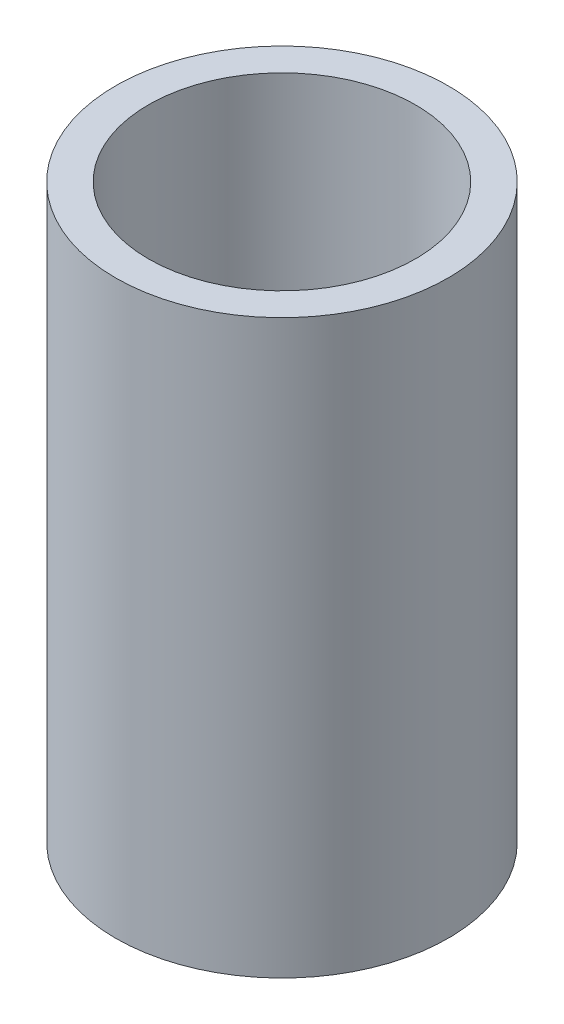
ISO-10303-21;
HEADER;
FILE_DESCRIPTION(('STEP AP214'),'2;1');
FILE_NAME('part.step','',(''),(''),'','','');
FILE_SCHEMA(('AUTOMOTIVE_DESIGN { 1 0 10303 214 1 1 1 1 }'));
ENDSEC;
DATA;
#1=APPLICATION_CONTEXT('core data for automotive mechanical design processes');
#2=APPLICATION_PROTOCOL_DEFINITION('international standard','automotive_design',2000,#1);
#3=PRODUCT_CONTEXT('',#1,'mechanical');
#4=PRODUCT('Part','Part','',(#3));
#5=PRODUCT_RELATED_PRODUCT_CATEGORY('part','',(#4));
#6=PRODUCT_DEFINITION_FORMATION('','',#4);
#7=PRODUCT_DEFINITION_CONTEXT('part definition',#1,'design');
#8=PRODUCT_DEFINITION('design','',#6,#7);
#9=PRODUCT_DEFINITION_SHAPE('','',#8);
#10=(LENGTH_UNIT() NAMED_UNIT(*) SI_UNIT(.MILLI.,.METRE.));
#11=(NAMED_UNIT(*) PLANE_ANGLE_UNIT() SI_UNIT($,.RADIAN.));
#12=(NAMED_UNIT(*) SI_UNIT($,.STERADIAN.) SOLID_ANGLE_UNIT());
#13=UNCERTAINTY_MEASURE_WITH_UNIT(LENGTH_MEASURE(1.E-05),#10,'distance_accuracy_value','');
#14=(GEOMETRIC_REPRESENTATION_CONTEXT(3) GLOBAL_UNCERTAINTY_ASSIGNED_CONTEXT((#13)) GLOBAL_UNIT_ASSIGNED_CONTEXT((#10,
#11,#12)) REPRESENTATION_CONTEXT('',''));
#15=CARTESIAN_POINT('',(0.,0.,0.));
#16=DIRECTION('',(0.,0.,1.));
#17=DIRECTION('',(1.,0.,0.));
#18=AXIS2_PLACEMENT_3D('',#15,#16,#17);
#19=CARTESIAN_POINT('',(0.,27.5,0.));
#20=DIRECTION('',(0.,1.,0.));
#21=DIRECTION('',(0.,0.,1.));
#22=AXIS2_PLACEMENT_3D('',#19,#20,#21);
#23=PLANE('',#22);
#24=CARTESIAN_POINT('',(0.,27.5,0.));
#25=DIRECTION('',(0.,1.,0.));
#26=DIRECTION('',(0.,0.,1.));
#27=AXIS2_PLACEMENT_3D('',#24,#25,#26);
#28=CIRCLE('',#27,16.);
#29=CARTESIAN_POINT('',(0.,27.5,16.));
#30=VERTEX_POINT('',#29);
#31=EDGE_CURVE('E10',#30,#30,#28,.T.);
#32=ORIENTED_EDGE('',*,*,#31,.T.);
#33=EDGE_LOOP('',(#32));
#34=FACE_BOUND('',#33,.T.);
#35=CARTESIAN_POINT('',(0.,27.5,0.));
#36=DIRECTION('',(0.,1.,0.));
#37=DIRECTION('',(0.,0.,1.));
#38=AXIS2_PLACEMENT_3D('',#35,#36,#37);
#39=CIRCLE('',#38,12.8397);
#40=CARTESIAN_POINT('',(0.,27.5,12.8397));
#41=VERTEX_POINT('',#40);
#42=EDGE_CURVE('E50',#41,#41,#39,.T.);
#43=ORIENTED_EDGE('',*,*,#42,.F.);
#44=EDGE_LOOP('',(#43));
#45=FACE_BOUND('',#44,.T.);
#46=ADVANCED_FACE('F37',(#34,#45),#23,.T.);
#47=CARTESIAN_POINT('',(0.,-27.5,0.));
#48=DIRECTION('',(0.,1.,0.));
#49=DIRECTION('',(0.,0.,1.));
#50=AXIS2_PLACEMENT_3D('',#47,#48,#49);
#51=PLANE('',#50);
#52=CARTESIAN_POINT('',(0.,-27.5,0.));
#53=DIRECTION('',(0.,1.,0.));
#54=DIRECTION('',(0.,0.,1.));
#55=AXIS2_PLACEMENT_3D('',#52,#53,#54);
#56=CIRCLE('',#55,16.);
#57=CARTESIAN_POINT('',(0.,-27.5,16.));
#58=VERTEX_POINT('',#57);
#59=EDGE_CURVE('E41',#58,#58,#56,.T.);
#60=ORIENTED_EDGE('',*,*,#59,.F.);
#61=EDGE_LOOP('',(#60));
#62=FACE_BOUND('',#61,.T.);
#63=CARTESIAN_POINT('',(0.,-27.5,0.));
#64=DIRECTION('',(0.,1.,0.));
#65=DIRECTION('',(0.,0.,1.));
#66=AXIS2_PLACEMENT_3D('',#63,#64,#65);
#67=CIRCLE('',#66,12.8397);
#68=CARTESIAN_POINT('',(0.,-27.5,12.8397));
#69=VERTEX_POINT('',#68);
#70=EDGE_CURVE('E52',#69,#69,#67,.T.);
#71=ORIENTED_EDGE('',*,*,#70,.T.);
#72=EDGE_LOOP('',(#71));
#73=FACE_BOUND('',#72,.T.);
#74=ADVANCED_FACE('F86',(#62,#73),#51,.F.);
#75=CARTESIAN_POINT('',(0.,27.5,0.));
#76=DIRECTION('',(0.,-1.,0.));
#77=DIRECTION('',(0.,0.,-1.));
#78=AXIS2_PLACEMENT_3D('',#75,#76,#77);
#79=CYLINDRICAL_SURFACE('',#78,16.);
#80=CARTESIAN_POINT('',(2.,0.,-15.8745078663875));
#81=CARTESIAN_POINT('',(1.99999524386716,-0.111869027033463,-15.8745094733706));
#82=CARTESIAN_POINT('',(1.99058231921703,-0.223807971923852,-15.8757031609516));
#83=CARTESIAN_POINT('',(1.95318113097707,-0.444570580323687,-15.8803471278398));
#84=CARTESIAN_POINT('',(1.92517345687304,-0.553390864397634,-15.8837997651437));
#85=CARTESIAN_POINT('',(1.85142135426077,-0.764687905692824,-15.8925645902034));
#86=CARTESIAN_POINT('',(1.80568896383859,-0.867168913694928,-15.8978755156292));
#87=CARTESIAN_POINT('',(1.69781135874362,-1.06298276145846,-15.9097569881593));
#88=CARTESIAN_POINT('',(1.63566894989983,-1.15631716139444,-15.9163273198743));
#89=CARTESIAN_POINT('',(1.49636276021153,-1.3317297976977,-15.9300284739512));
#90=CARTESIAN_POINT('',(1.41912545201944,-1.41374944185511,-15.9371619336163));
#91=CARTESIAN_POINT('',(1.25198020853698,-1.56369821515126,-15.9511618630067));
#92=CARTESIAN_POINT('',(1.16207164324643,-1.63162664327575,-15.9580283194351));
#93=CARTESIAN_POINT('',(0.971767864540777,-1.75167486360509,-15.9707475569026));
#94=CARTESIAN_POINT('',(0.871338956448891,-1.80374163607973,-15.9765969107744));
#95=CARTESIAN_POINT('',(0.663077374444734,-1.89024895995277,-15.9865938956362));
#96=CARTESIAN_POINT('',(0.555244975488724,-1.92469016554121,-15.9907415897837));
#97=CARTESIAN_POINT('',(0.33583655020089,-1.97479365466754,-15.9968493496498));
#98=CARTESIAN_POINT('',(0.224283087730703,-1.99055334281911,-15.9988207586875));
#99=CARTESIAN_POINT('',(9.85605492377487E-05,-2.00314830802923,-16.0003925578337));
#100=CARTESIAN_POINT('',(-0.112532461595816,-1.99998432956203,-15.9999930412166));
#101=CARTESIAN_POINT('',(-0.335012215179638,-1.97489983779406,-15.9968771821601));
#102=CARTESIAN_POINT('',(-0.444872964611562,-1.9530840812149,-15.9941737796458));
#103=CARTESIAN_POINT('',(-0.6593617311243,-1.89147905869605,-15.9867684475387));
#104=CARTESIAN_POINT('',(-0.763989648684964,-1.85168945106654,-15.9820664799524));
#105=CARTESIAN_POINT('',(-0.965367052350911,-1.75515480577297,-15.9711700624633));
#106=CARTESIAN_POINT('',(-1.06209458227242,-1.69836443381586,-15.9649716307459));
#107=CARTESIAN_POINT('',(-1.24468596184518,-1.56947331022718,-15.9517757525223));
#108=CARTESIAN_POINT('',(-1.33054931297389,-1.49737185642514,-15.9447782693781));
#109=CARTESIAN_POINT('',(-1.48959042461836,-1.3393185451213,-15.9307109401881));
#110=CARTESIAN_POINT('',(-1.5626774719968,-1.25327539236267,-15.9236409264378));
#111=CARTESIAN_POINT('',(-1.69338628050008,-1.07009475457404,-15.9102725755246));
#112=CARTESIAN_POINT('',(-1.75100799314808,-0.972957234769554,-15.9039742407806));
#113=CARTESIAN_POINT('',(-1.84915565886619,-0.770264403550139,-15.8928624209017));
#114=CARTESIAN_POINT('',(-1.88967434388986,-0.664705536037441,-15.888049567265));
#115=CARTESIAN_POINT('',(-1.95238532357447,-0.448208437178536,-15.8804659399676));
#116=CARTESIAN_POINT('',(-1.9745785014397,-0.337270465353024,-15.8776950678936));
#117=CARTESIAN_POINT('',(-1.99988834552689,-0.113965454400189,-15.8745271102724));
#118=CARTESIAN_POINT('',(-2.00313267359863,-0.00161310152896618,-15.874114139539));
#119=CARTESIAN_POINT('',(-1.99078956258445,0.22203354373233,-15.8756667289572));
#120=CARTESIAN_POINT('',(-1.97520252488785,0.333327858623452,-15.8776322384116));
#121=CARTESIAN_POINT('',(-1.92574662863818,0.55131661086229,-15.8837058278719));
#122=CARTESIAN_POINT('',(-1.89193958699685,0.658025292152324,-15.8878066615573));
#123=CARTESIAN_POINT('',(-1.8070669752929,0.864259323882524,-15.8976829597665));
#124=CARTESIAN_POINT('',(-1.75600079886498,0.963784421792695,-15.9034584831261));
#125=CARTESIAN_POINT('',(-1.63774561772394,1.15340371505039,-15.9160714508259));
#126=CARTESIAN_POINT('',(-1.57047289566169,1.24344533225154,-15.9229143418967));
#127=CARTESIAN_POINT('',(-1.42183259389516,1.41100524314803,-15.9368739164082));
#128=CARTESIAN_POINT('',(-1.34046446594039,1.48852304949439,-15.9439906104903));
#129=CARTESIAN_POINT('',(-1.16538542044682,1.62928334986752,-15.9577447094957));
#130=CARTESIAN_POINT('',(-1.07160679369363,1.69244195743599,-15.9643791513002));
#131=CARTESIAN_POINT('',(-0.874698065345432,1.80211057410704,-15.9763769042529));
#132=CARTESIAN_POINT('',(-0.771568152294659,1.84862091878478,-15.9817402410217));
#133=CARTESIAN_POINT('',(-0.559163087311564,1.92353422952643,-15.9905783252255));
#134=CARTESIAN_POINT('',(-0.449905253209423,1.95198567682529,-15.9940581255016));
#135=CARTESIAN_POINT('',(-0.228116845822369,1.99013127138141,-15.9987580374205));
#136=CARTESIAN_POINT('',(-0.115586420350486,1.99982626447939,-15.9999782509614));
#137=CARTESIAN_POINT('',(0.108733746675027,2.00016793783372,-16.0000210241093));
#138=CARTESIAN_POINT('',(0.220523310171787,1.99094396845438,-15.9988598653427));
#139=CARTESIAN_POINT('',(0.44095019316209,1.95398350925533,-15.9943027292635));
#140=CARTESIAN_POINT('',(0.549587514847879,1.92624703231059,-15.9909067535052));
#141=CARTESIAN_POINT('',(0.760609154389852,1.85308950852024,-15.9822598816963));
#142=CARTESIAN_POINT('',(0.862995648127657,1.80767465650142,-15.9770096354758));
#143=CARTESIAN_POINT('',(1.05871466971522,1.70046294831396,-15.9652355808503));
#144=CARTESIAN_POINT('',(1.15204708991042,1.63866589739065,-15.958711757305));
#145=CARTESIAN_POINT('',(1.32766941437005,1.4999654277309,-15.9450655514046));
#146=CARTESIAN_POINT('',(1.40988303026744,1.42296576518108,-15.9379395302314));
#147=CARTESIAN_POINT('',(1.56027289505548,1.25624564477691,-15.9239212721083));
#148=CARTESIAN_POINT('',(1.62844581423479,1.16652217800728,-15.917029090936));
#149=CARTESIAN_POINT('',(1.74904419401283,0.97650406184211,-15.9042304911575));
#150=CARTESIAN_POINT('',(1.80140782653339,0.876169928051929,-15.8983279820183));
#151=CARTESIAN_POINT('',(1.88846823067468,0.668114607524193,-15.888222864957));
#152=CARTESIAN_POINT('',(1.92318421698265,0.560401600557285,-15.884018409231));
#153=CARTESIAN_POINT('',(1.96565271699038,0.376776010365174,-15.8788062945587));
#154=CARTESIAN_POINT('',(1.97851442480846,0.302021638769942,-15.8772024121753));
#155=CARTESIAN_POINT('',(1.99568964472441,0.151522200026459,-15.8750526578393));
#156=CARTESIAN_POINT('',(2.00000322167946,0.075777140399238,-15.8745067778594));
#157=CARTESIAN_POINT('',(2.,0.,-15.8745078663875));
#158=B_SPLINE_CURVE_WITH_KNOTS('',3,(#80,#81,#82,#83,#84,#85,#86,#87,#88,#89,#90,#91,#92,#93,
#94,#95,#96,#97,#98,#99,#100,#101,#102,#103,#104,#105,#106,#107,#108,#109,#110,#111,#112,#113,
#114,#115,#116,#117,#118,#119,#120,#121,#122,#123,#124,#125,#126,#127,#128,#129,#130,#131,#132,
#133,#134,#135,#136,#137,#138,#139,#140,#141,#142,#143,#144,#145,#146,#147,#148,#149,#150,#151,
#152,#153,#154,#155,#156,#157),.UNSPECIFIED.,.T.,.F.,(4,2,2,2,2,2,2,2,2,2,2,2,2,2,2,2,2,2,2,2,2,
2,2,2,2,2,2,2,2,2,2,2,2,2,2,2,2,2,4),(0.,0.335330253983391,0.671011100921905,1.00646436206496,
1.3418603036049,1.67893262039253,2.01602170194063,2.35422548916593,2.69241672271864,
3.02883677553166,3.36524359336087,3.69977331946431,4.03430940537431,4.36974563530243,
4.70519725175284,5.04294157902216,5.3806869649554,5.71857573391207,6.05644821724951,
6.39204174244706,6.72762811461692,7.06208301034186,7.39654965769482,7.73278255635289,
8.06902853595849,8.40719108713874,8.74534682167103,9.08259085427953,9.4198196781825,
9.75475053030604,10.0896811494943,10.4244945083527,10.759311847714,11.0963210311267,
11.4334100435186,11.7718007816387,12.1098222878561,12.3369679170636,12.5641118228438),.UNSPECIFIED.);
#159=CARTESIAN_POINT('',(2.,0.,-15.8745078663875));
#160=VERTEX_POINT('',#159);
#161=EDGE_CURVE('E56',#160,#160,#158,.T.);
#162=ORIENTED_EDGE('',*,*,#161,.F.);
#163=EDGE_LOOP('',(#162));
#164=FACE_BOUND('',#163,.T.);
#165=ORIENTED_EDGE('',*,*,#31,.F.);
#166=EDGE_LOOP('',(#165));
#167=FACE_BOUND('',#166,.T.);
#168=ORIENTED_EDGE('',*,*,#59,.T.);
#169=EDGE_LOOP('',(#168));
#170=FACE_BOUND('',#169,.T.);
#171=ADVANCED_FACE('F39',(#164,#167,#170),#79,.T.);
#172=CARTESIAN_POINT('',(0.,27.5,0.));
#173=DIRECTION('',(0.,-1.,0.));
#174=DIRECTION('',(0.,0.,-1.));
#175=AXIS2_PLACEMENT_3D('',#172,#173,#174);
#176=CYLINDRICAL_SURFACE('',#175,12.8397);
#177=CARTESIAN_POINT('',(2.,0.,-12.6829766257768));
#178=CARTESIAN_POINT('',(1.99999542977878,-0.111607276056529,-12.6829785457113));
#179=CARTESIAN_POINT('',(1.9906262550867,-0.223278057069677,-12.6844657521694));
#180=CARTESIAN_POINT('',(1.95340916992859,-0.443493718604813,-12.6902493969685));
#181=CARTESIAN_POINT('',(1.92554356429497,-0.552035501820932,-12.6945485253615));
#182=CARTESIAN_POINT('',(1.85219070531248,-0.762773914635226,-12.7054575408193));
#183=CARTESIAN_POINT('',(1.8067173774827,-0.864975484629886,-12.7120656014036));
#184=CARTESIAN_POINT('',(1.69947334207441,-1.06028466337821,-12.7268457550844));
#185=CARTESIAN_POINT('',(1.6377047406341,-1.15339344523092,-12.7350176460208));
#186=CARTESIAN_POINT('',(1.49905486623623,-1.32869033521887,-12.7520834759852));
#187=CARTESIAN_POINT('',(1.42206067640262,-1.41078864914235,-12.7609824991777));
#188=CARTESIAN_POINT('',(1.2553891117973,-1.5609553895935,-12.7784545932513));
#189=CARTESIAN_POINT('',(1.16571102229922,-1.62902302497351,-12.7870276457297));
#190=CARTESIAN_POINT('',(0.97563976613991,-1.74952949425379,-12.8029352549501));
#191=CARTESIAN_POINT('',(0.875193376616871,-1.80188533580186,-12.8102631492856));
#192=CARTESIAN_POINT('',(0.666799091609416,-1.88894915359878,-12.8227983844469));
#193=CARTESIAN_POINT('',(0.55885162333829,-1.92365813396469,-12.8280058459232));
#194=CARTESIAN_POINT('',(0.339445239072281,-1.97416992566217,-12.8356775995631));
#195=CARTESIAN_POINT('',(0.228021758164113,-1.99012328547367,-12.8381637241908));
#196=CARTESIAN_POINT('',(0.00405357392589063,-2.00313866942103,-12.8401875741457));
#197=CARTESIAN_POINT('',(-0.10849106202608,-2.00020182204504,-12.8397254755978));
#198=CARTESIAN_POINT('',(-0.330478957235813,-1.97563849650837,-12.8359223352649));
#199=CARTESIAN_POINT('',(-0.439940628625049,-1.95417400238219,-12.8326062461628));
#200=CARTESIAN_POINT('',(-0.653689310900628,-1.89341921356911,-12.8234955215894));
#201=CARTESIAN_POINT('',(-0.757976180140698,-1.85412843123383,-12.8177008183144));
#202=CARTESIAN_POINT('',(-0.95890235867002,-1.75867218476378,-12.8042411982205));
#203=CARTESIAN_POINT('',(-1.05550897996187,-1.7024390132491,-12.7965688010508));
#204=CARTESIAN_POINT('',(-1.23797598004017,-1.57474373089401,-12.7802079916615));
#205=CARTESIAN_POINT('',(-1.32383559627582,-1.50328054038296,-12.7715195074303));
#206=CARTESIAN_POINT('',(-1.48332694066247,-1.34625273070919,-12.7539858519419));
#207=CARTESIAN_POINT('',(-1.55681936912239,-1.26054663295548,-12.7451399961125));
#208=CARTESIAN_POINT('',(-1.68840108800969,-1.07794522818329,-12.728378185602));
#209=CARTESIAN_POINT('',(-1.74649026892984,-0.981049841623157,-12.720462237532));
#210=CARTESIAN_POINT('',(-1.84563822593332,-0.77866970537138,-12.7064565152555));
#211=CARTESIAN_POINT('',(-1.88668186456936,-0.673177420137374,-12.7003683655653));
#212=CARTESIAN_POINT('',(-1.95042917272159,-0.456680485902559,-12.6907356527962));
#213=CARTESIAN_POINT('',(-1.97313424162605,-0.345676258195963,-12.687190895637));
#214=CARTESIAN_POINT('',(-1.99936714704614,-0.122548148921297,-12.6830833843374));
#215=CARTESIAN_POINT('',(-2.00309281981069,-0.0104480737915694,-12.682489868792));
#216=CARTESIAN_POINT('',(-1.99178687903282,0.212775016673244,-12.6842702826835));
#217=CARTESIAN_POINT('',(-1.9767558948551,0.323898064665708,-12.6866441125535));
#218=CARTESIAN_POINT('',(-1.92853140531546,0.54139463469342,-12.6940634341268));
#219=CARTESIAN_POINT('',(-1.89543717724934,0.647790711097513,-12.6990943175652));
#220=CARTESIAN_POINT('',(-1.81212917783692,0.853525951972127,-12.7112487753018));
#221=CARTESIAN_POINT('',(-1.76191450051324,0.952864742650028,-12.7183724603437));
#222=CARTESIAN_POINT('',(-1.64531850401305,1.14255026661764,-12.7339820010502));
#223=CARTESIAN_POINT('',(-1.57880954956105,1.23281766039176,-12.7424784212926));
#224=CARTESIAN_POINT('',(-1.43168962123954,1.40098087837006,-12.7598445926537));
#225=CARTESIAN_POINT('',(-1.35107778529713,1.47887594573003,-12.7687143665693));
#226=CARTESIAN_POINT('',(-1.17716734120527,1.62079783873587,-12.7859243764992));
#227=CARTESIAN_POINT('',(-1.08376088735345,1.68469327656428,-12.7942591162978));
#228=CARTESIAN_POINT('',(-0.887425051562714,1.79588512282439,-12.8093736407735));
#229=CARTESIAN_POINT('',(-0.784495946636571,1.84318201391408,-12.8161534706628));
#230=CARTESIAN_POINT('',(-0.572440123105982,1.91962607404538,-12.8273702558943));
#231=CARTESIAN_POINT('',(-0.463339431648914,1.94884404596164,-12.8318163404163));
#232=CARTESIAN_POINT('',(-0.241705527864347,1.98852964793012,-12.8379030964421));
#233=CARTESIAN_POINT('',(-0.12917256139234,1.99899861778925,-12.8395439684064));
#234=CARTESIAN_POINT('',(0.0948592684789221,2.00085437846246,-12.8398331331113));
#235=CARTESIAN_POINT('',(0.206356480772478,1.99244182218366,-12.8385128935217));
#236=CARTESIAN_POINT('',(0.426329938814471,1.95720473092383,-12.8330918918235));
#237=CARTESIAN_POINT('',(0.534806196516737,1.93038026880893,-12.8289911407188));
#238=CARTESIAN_POINT('',(0.745596163367876,1.85915397745186,-12.8184678786045));
#239=CARTESIAN_POINT('',(0.847915032597578,1.81476710920334,-12.812047344166));
#240=CARTESIAN_POINT('',(1.04368427827067,1.70969767956155,-12.7975882723877));
#241=CARTESIAN_POINT('',(1.13713432160449,1.64901450641313,-12.7895496743094));
#242=CARTESIAN_POINT('',(1.31352868347907,1.51235419810328,-12.7726457758987));
#243=CARTESIAN_POINT('',(1.39635781662491,1.43622930122635,-12.7637729703121));
#244=CARTESIAN_POINT('',(1.54813840323443,1.27115726359509,-12.7462549869285));
#245=CARTESIAN_POINT('',(1.61708659873067,1.18220712104061,-12.737609862983));
#246=CARTESIAN_POINT('',(1.73952868899153,0.993369657310034,-12.7214694302167));
#247=CARTESIAN_POINT('',(1.79292582572072,0.893418976800107,-12.713981450886));
#248=CARTESIAN_POINT('',(1.88209325894994,0.685895674524483,-12.7010892562388));
#249=CARTESIAN_POINT('',(1.91788162046716,0.578330994211954,-12.6956829066015));
#250=CARTESIAN_POINT('',(1.96280986898783,0.391920080612976,-12.6887985026181));
#251=CARTESIAN_POINT('',(1.9767344864936,0.314217938406258,-12.6866270609447));
#252=CARTESIAN_POINT('',(1.99533109913859,0.157687754972058,-12.6837154546665));
#253=CARTESIAN_POINT('',(2.0000032292376,0.0788597301839604,-12.6829752691849));
#254=CARTESIAN_POINT('',(2.,0.,-12.6829766257768));
#255=B_SPLINE_CURVE_WITH_KNOTS('',3,(#177,#178,#179,#180,#181,#182,#183,#184,#185,#186,#187,
#188,#189,#190,#191,#192,#193,#194,#195,#196,#197,#198,#199,#200,#201,#202,#203,#204,#205,#206,
#207,#208,#209,#210,#211,#212,#213,#214,#215,#216,#217,#218,#219,#220,#221,#222,#223,#224,#225,
#226,#227,#228,#229,#230,#231,#232,#233,#234,#235,#236,#237,#238,#239,#240,#241,#242,#243,#244,
#245,#246,#247,#248,#249,#250,#251,#252,#253,#254),.UNSPECIFIED.,.T.,.F.,(4,2,2,2,2,2,2,2,2,2,2,
2,2,2,2,2,2,2,2,2,2,2,2,2,2,2,2,2,2,2,2,2,2,2,2,2,2,2,4),(0.,0.334533542957228,
0.669387589659937,1.00397734758014,1.33852388147499,1.67565142198752,2.01279796690811,
2.35169523931521,2.69057322610413,3.02671210603486,3.36283090544359,3.69604050187787,
4.02925921400191,4.36382765080858,4.69841981338619,5.03655953152533,5.37470165355713,
5.71314342691742,6.05155937186193,6.38644043316251,6.72131025809763,7.05435787297391,
7.38742311475016,7.72318575244836,8.05896892162995,8.39777994708913,8.73658111967359,
9.07404689748069,9.4114885589631,9.74536124502395,10.0792326097727,10.4128201677403,
10.7464202501692,11.0833774354427,11.4204136153061,11.7595040868262,12.0982459529255,
12.3346248941633,12.5710003874755),.UNSPECIFIED.);
#256=CARTESIAN_POINT('',(2.,0.,-12.6829766257768));
#257=VERTEX_POINT('',#256);
#258=EDGE_CURVE('E68',#257,#257,#255,.T.);
#259=ORIENTED_EDGE('',*,*,#258,.T.);
#260=EDGE_LOOP('',(#259));
#261=FACE_BOUND('',#260,.T.);
#262=ORIENTED_EDGE('',*,*,#42,.T.);
#263=EDGE_LOOP('',(#262));
#264=FACE_BOUND('',#263,.T.);
#265=ORIENTED_EDGE('',*,*,#70,.F.);
#266=EDGE_LOOP('',(#265));
#267=FACE_BOUND('',#266,.T.);
#268=ADVANCED_FACE('F79',(#261,#264,#267),#176,.F.);
#269=CARTESIAN_POINT('',(0.,0.,-16.001));
#270=DIRECTION('',(0.,0.,1.));
#271=DIRECTION('',(1.,0.,0.));
#272=AXIS2_PLACEMENT_3D('',#269,#270,#271);
#273=CYLINDRICAL_SURFACE('',#272,2.);
#274=ORIENTED_EDGE('',*,*,#258,.F.);
#275=EDGE_LOOP('',(#274));
#276=FACE_BOUND('',#275,.T.);
#277=ORIENTED_EDGE('',*,*,#161,.T.);
#278=EDGE_LOOP('',(#277));
#279=FACE_BOUND('',#278,.T.);
#280=ADVANCED_FACE('F73',(#276,#279),#273,.F.);
#281=CLOSED_SHELL('',(#46,#74,#171,#268,#280));
#282=MANIFOLD_SOLID_BREP('B2',#281);
#283=ADVANCED_BREP_SHAPE_REPRESENTATION('',(#18,#282),#14);
#284=SHAPE_DEFINITION_REPRESENTATION(#9,#283);
ENDSEC;
END-ISO-10303-21;
